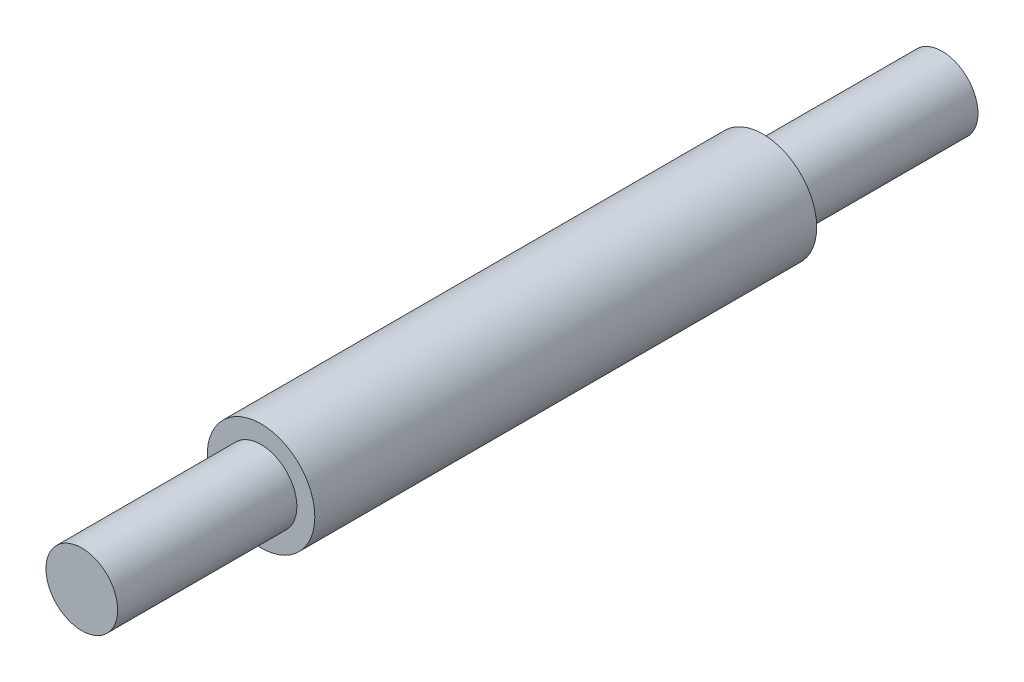
ISO-10303-21;
HEADER;
FILE_DESCRIPTION(('STEP AP214'),'2;1');
FILE_NAME('part.step','',(''),(''),'','','');
FILE_SCHEMA(('AUTOMOTIVE_DESIGN { 1 0 10303 214 1 1 1 1 }'));
ENDSEC;
DATA;
#1=APPLICATION_CONTEXT('core data for automotive mechanical design processes');
#2=APPLICATION_PROTOCOL_DEFINITION('international standard','automotive_design',2000,#1);
#3=PRODUCT_CONTEXT('',#1,'mechanical');
#4=PRODUCT('Part','Part','',(#3));
#5=PRODUCT_RELATED_PRODUCT_CATEGORY('part','',(#4));
#6=PRODUCT_DEFINITION_FORMATION('','',#4);
#7=PRODUCT_DEFINITION_CONTEXT('part definition',#1,'design');
#8=PRODUCT_DEFINITION('design','',#6,#7);
#9=PRODUCT_DEFINITION_SHAPE('','',#8);
#10=(LENGTH_UNIT() NAMED_UNIT(*) SI_UNIT(.MILLI.,.METRE.));
#11=(NAMED_UNIT(*) PLANE_ANGLE_UNIT() SI_UNIT($,.RADIAN.));
#12=(NAMED_UNIT(*) SI_UNIT($,.STERADIAN.) SOLID_ANGLE_UNIT());
#13=UNCERTAINTY_MEASURE_WITH_UNIT(LENGTH_MEASURE(1.E-05),#10,'distance_accuracy_value','');
#14=(GEOMETRIC_REPRESENTATION_CONTEXT(3) GLOBAL_UNCERTAINTY_ASSIGNED_CONTEXT((#13)) GLOBAL_UNIT_ASSIGNED_CONTEXT((#10,
#11,#12)) REPRESENTATION_CONTEXT('',''));
#15=CARTESIAN_POINT('',(0.,0.,0.));
#16=DIRECTION('',(0.,0.,1.));
#17=DIRECTION('',(1.,0.,0.));
#18=AXIS2_PLACEMENT_3D('',#15,#16,#17);
#19=CARTESIAN_POINT('',(0.,0.,0.));
#20=DIRECTION('',(0.,0.,1.));
#21=DIRECTION('',(1.,0.,0.));
#22=AXIS2_PLACEMENT_3D('',#19,#20,#21);
#23=PLANE('',#22);
#24=CARTESIAN_POINT('',(0.,0.,0.));
#25=DIRECTION('',(0.,0.,1.));
#26=DIRECTION('',(1.,0.,0.));
#27=AXIS2_PLACEMENT_3D('',#24,#25,#26);
#28=CIRCLE('',#27,19.05);
#29=CARTESIAN_POINT('',(19.05,0.,0.));
#30=VERTEX_POINT('',#29);
#31=EDGE_CURVE('E41',#30,#30,#28,.T.);
#32=ORIENTED_EDGE('',*,*,#31,.F.);
#33=EDGE_LOOP('',(#32));
#34=FACE_BOUND('',#33,.T.);
#35=CARTESIAN_POINT('',(0.,0.,0.));
#36=DIRECTION('',(0.,0.,1.));
#37=DIRECTION('',(1.,0.,0.));
#38=AXIS2_PLACEMENT_3D('',#35,#36,#37);
#39=CIRCLE('',#38,12.7);
#40=CARTESIAN_POINT('',(12.7,0.,0.));
#41=VERTEX_POINT('',#40);
#42=EDGE_CURVE('E10',#41,#41,#39,.F.);
#43=ORIENTED_EDGE('',*,*,#42,.F.);
#44=EDGE_LOOP('',(#43));
#45=FACE_BOUND('',#44,.T.);
#46=ADVANCED_FACE('F30',(#34,#45),#23,.F.);
#47=CARTESIAN_POINT('',(0.,0.,177.8));
#48=DIRECTION('',(0.,0.,1.));
#49=DIRECTION('',(1.,0.,0.));
#50=AXIS2_PLACEMENT_3D('',#47,#48,#49);
#51=PLANE('',#50);
#52=CARTESIAN_POINT('',(0.,0.,177.8));
#53=DIRECTION('',(0.,0.,1.));
#54=DIRECTION('',(1.,0.,0.));
#55=AXIS2_PLACEMENT_3D('',#52,#53,#54);
#56=CIRCLE('',#55,19.05);
#57=CARTESIAN_POINT('',(19.05,0.,177.8));
#58=VERTEX_POINT('',#57);
#59=EDGE_CURVE('E37',#58,#58,#56,.T.);
#60=ORIENTED_EDGE('',*,*,#59,.T.);
#61=EDGE_LOOP('',(#60));
#62=FACE_BOUND('',#61,.T.);
#63=CARTESIAN_POINT('',(0.,0.,177.8));
#64=DIRECTION('',(0.,0.,1.));
#65=DIRECTION('',(1.,0.,0.));
#66=AXIS2_PLACEMENT_3D('',#63,#64,#65);
#67=CIRCLE('',#66,12.7);
#68=CARTESIAN_POINT('',(12.7,0.,177.8));
#69=VERTEX_POINT('',#68);
#70=EDGE_CURVE('E48',#69,#69,#67,.T.);
#71=ORIENTED_EDGE('',*,*,#70,.F.);
#72=EDGE_LOOP('',(#71));
#73=FACE_BOUND('',#72,.T.);
#74=ADVANCED_FACE('F72',(#62,#73),#51,.T.);
#75=CARTESIAN_POINT('',(0.,0.,177.8));
#76=DIRECTION('',(0.,0.,-1.));
#77=DIRECTION('',(-1.,0.,0.));
#78=AXIS2_PLACEMENT_3D('',#75,#76,#77);
#79=CYLINDRICAL_SURFACE('',#78,19.05);
#80=ORIENTED_EDGE('',*,*,#59,.F.);
#81=EDGE_LOOP('',(#80));
#82=FACE_BOUND('',#81,.T.);
#83=ORIENTED_EDGE('',*,*,#31,.T.);
#84=EDGE_LOOP('',(#83));
#85=FACE_BOUND('',#84,.T.);
#86=ADVANCED_FACE('F32',(#82,#85),#79,.T.);
#87=CARTESIAN_POINT('',(0.,0.,241.3));
#88=DIRECTION('',(0.,0.,-1.));
#89=DIRECTION('',(-1.,0.,0.));
#90=AXIS2_PLACEMENT_3D('',#87,#88,#89);
#91=CYLINDRICAL_SURFACE('',#90,12.7);
#92=CARTESIAN_POINT('',(0.,0.,241.3));
#93=DIRECTION('',(0.,0.,1.));
#94=DIRECTION('',(1.,0.,0.));
#95=AXIS2_PLACEMENT_3D('',#92,#93,#94);
#96=CIRCLE('',#95,12.7);
#97=CARTESIAN_POINT('',(12.7,0.,241.3));
#98=VERTEX_POINT('',#97);
#99=EDGE_CURVE('E46',#98,#98,#96,.T.);
#100=ORIENTED_EDGE('',*,*,#99,.F.);
#101=EDGE_LOOP('',(#100));
#102=FACE_BOUND('',#101,.T.);
#103=ORIENTED_EDGE('',*,*,#70,.T.);
#104=EDGE_LOOP('',(#103));
#105=FACE_BOUND('',#104,.T.);
#106=ADVANCED_FACE('F68',(#102,#105),#91,.T.);
#107=CARTESIAN_POINT('',(0.,0.,241.3));
#108=DIRECTION('',(0.,0.,1.));
#109=DIRECTION('',(1.,0.,0.));
#110=AXIS2_PLACEMENT_3D('',#107,#108,#109);
#111=PLANE('',#110);
#112=ORIENTED_EDGE('',*,*,#99,.T.);
#113=EDGE_LOOP('',(#112));
#114=FACE_BOUND('',#113,.T.);
#115=ADVANCED_FACE('F61',(#114),#111,.T.);
#116=CARTESIAN_POINT('',(0.,0.,-63.5));
#117=DIRECTION('',(0.,0.,1.));
#118=DIRECTION('',(1.,0.,0.));
#119=AXIS2_PLACEMENT_3D('',#116,#117,#118);
#120=CYLINDRICAL_SURFACE('',#119,12.7);
#121=CARTESIAN_POINT('',(0.,0.,-63.5));
#122=DIRECTION('',(0.,0.,-1.));
#123=DIRECTION('',(-1.,0.,0.));
#124=AXIS2_PLACEMENT_3D('',#121,#122,#123);
#125=CIRCLE('',#124,12.7);
#126=CARTESIAN_POINT('',(-12.7,0.,-63.5));
#127=VERTEX_POINT('',#126);
#128=EDGE_CURVE('E51',#127,#127,#125,.T.);
#129=ORIENTED_EDGE('',*,*,#128,.F.);
#130=EDGE_LOOP('',(#129));
#131=FACE_BOUND('',#130,.T.);
#132=ORIENTED_EDGE('',*,*,#42,.T.);
#133=EDGE_LOOP('',(#132));
#134=FACE_BOUND('',#133,.T.);
#135=ADVANCED_FACE('F59',(#131,#134),#120,.T.);
#136=CARTESIAN_POINT('',(0.,0.,-63.5));
#137=DIRECTION('',(0.,0.,-1.));
#138=DIRECTION('',(-1.,0.,0.));
#139=AXIS2_PLACEMENT_3D('',#136,#137,#138);
#140=PLANE('',#139);
#141=ORIENTED_EDGE('',*,*,#128,.T.);
#142=EDGE_LOOP('',(#141));
#143=FACE_BOUND('',#142,.T.);
#144=ADVANCED_FACE('F57',(#143),#140,.T.);
#145=CLOSED_SHELL('',(#46,#74,#86,#106,#115,#135,#144));
#146=MANIFOLD_SOLID_BREP('B2',#145);
#147=ADVANCED_BREP_SHAPE_REPRESENTATION('',(#18,#146),#14);
#148=SHAPE_DEFINITION_REPRESENTATION(#9,#147);
ENDSEC;
END-ISO-10303-21;
